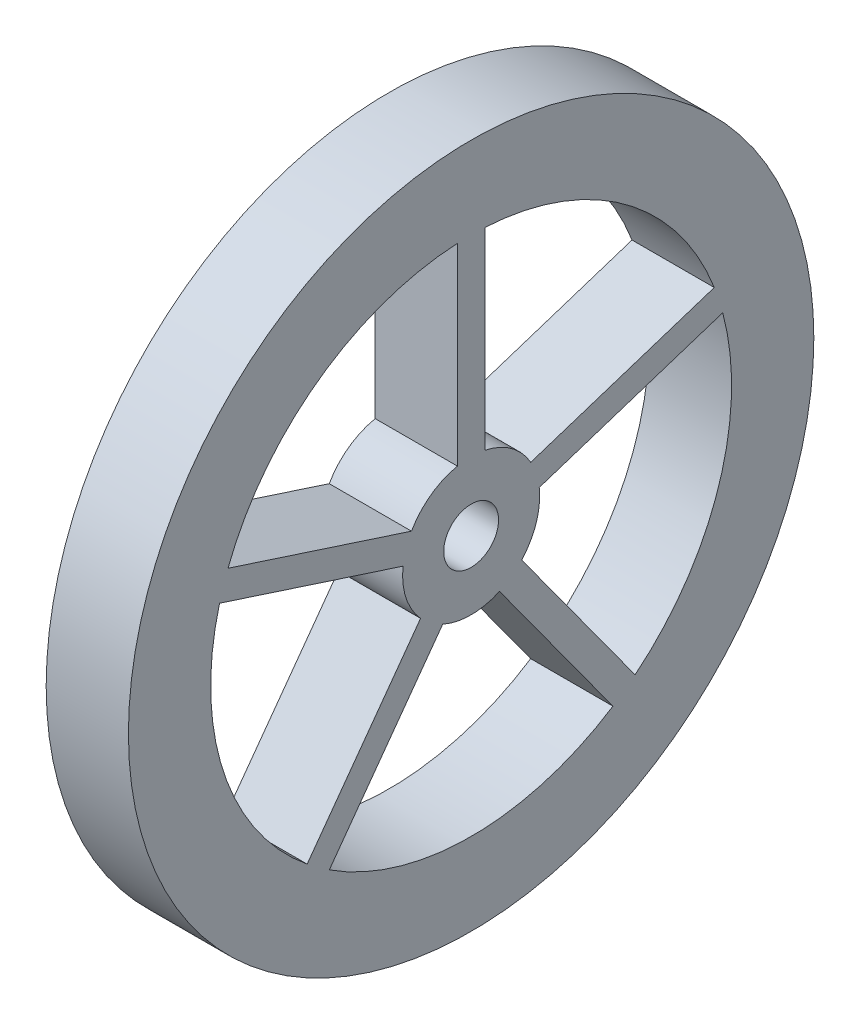
ISO-10303-21;
HEADER;
FILE_DESCRIPTION(('STEP AP214'),'2;1');
FILE_NAME('part.step','',(''),(''),'','','');
FILE_SCHEMA(('AUTOMOTIVE_DESIGN { 1 0 10303 214 1 1 1 1 }'));
ENDSEC;
DATA;
#1=APPLICATION_CONTEXT('core data for automotive mechanical design processes');
#2=APPLICATION_PROTOCOL_DEFINITION('international standard','automotive_design',2000,#1);
#3=PRODUCT_CONTEXT('',#1,'mechanical');
#4=PRODUCT('Part','Part','',(#3));
#5=PRODUCT_RELATED_PRODUCT_CATEGORY('part','',(#4));
#6=PRODUCT_DEFINITION_FORMATION('','',#4);
#7=PRODUCT_DEFINITION_CONTEXT('part definition',#1,'design');
#8=PRODUCT_DEFINITION('design','',#6,#7);
#9=PRODUCT_DEFINITION_SHAPE('','',#8);
#10=(LENGTH_UNIT() NAMED_UNIT(*) SI_UNIT(.MILLI.,.METRE.));
#11=(NAMED_UNIT(*) PLANE_ANGLE_UNIT() SI_UNIT($,.RADIAN.));
#12=(NAMED_UNIT(*) SI_UNIT($,.STERADIAN.) SOLID_ANGLE_UNIT());
#13=UNCERTAINTY_MEASURE_WITH_UNIT(LENGTH_MEASURE(1.E-05),#10,'distance_accuracy_value','');
#14=(GEOMETRIC_REPRESENTATION_CONTEXT(3) GLOBAL_UNCERTAINTY_ASSIGNED_CONTEXT((#13)) GLOBAL_UNIT_ASSIGNED_CONTEXT((#10,
#11,#12)) REPRESENTATION_CONTEXT('',''));
#15=CARTESIAN_POINT('',(0.,0.,0.));
#16=DIRECTION('',(0.,0.,1.));
#17=DIRECTION('',(1.,0.,0.));
#18=AXIS2_PLACEMENT_3D('',#15,#16,#17);
#19=CARTESIAN_POINT('',(60.,0.,0.));
#20=DIRECTION('',(1.,0.,0.));
#21=DIRECTION('',(0.,0.,-1.));
#22=AXIS2_PLACEMENT_3D('',#19,#20,#21);
#23=PLANE('',#22);
#24=CARTESIAN_POINT('',(60.,0.,0.));
#25=DIRECTION('',(1.,0.,0.));
#26=DIRECTION('',(0.,0.,-1.));
#27=AXIS2_PLACEMENT_3D('',#24,#25,#26);
#28=CIRCLE('',#27,250.);
#29=CARTESIAN_POINT('',(60.,0.,-250.));
#30=VERTEX_POINT('',#29);
#31=EDGE_CURVE('E11',#30,#30,#28,.T.);
#32=ORIENTED_EDGE('',*,*,#31,.T.);
#33=EDGE_LOOP('',(#32));
#34=FACE_BOUND('',#33,.T.);
#35=CARTESIAN_POINT('',(60.,0.,0.));
#36=DIRECTION('',(1.,0.,0.));
#37=DIRECTION('',(0.,0.,-1.));
#38=AXIS2_PLACEMENT_3D('',#35,#36,#37);
#39=CIRCLE('',#38,20.);
#40=CARTESIAN_POINT('',(60.,0.,-20.));
#41=VERTEX_POINT('',#40);
#42=EDGE_CURVE('E334',#41,#41,#39,.T.);
#43=ORIENTED_EDGE('',*,*,#42,.F.);
#44=EDGE_LOOP('',(#43));
#45=FACE_BOUND('',#44,.T.);
#46=DIRECTION('',(0.,-1.,0.));
#47=VECTOR('',#46,1.);
#48=CARTESIAN_POINT('',(60.,189.736659610103,-9.99999999999997));
#49=LINE('',#48,#47);
#50=CARTESIAN_POINT('',(60.,189.736659610103,-9.99999999999997));
#51=VERTEX_POINT('',#50);
#52=CARTESIAN_POINT('',(60.,48.9897948556761,-9.99999999999997));
#53=VERTEX_POINT('',#52);
#54=EDGE_CURVE('E305',#51,#53,#49,.T.);
#55=ORIENTED_EDGE('',*,*,#54,.F.);
#56=CARTESIAN_POINT('',(60.,0.,0.));
#57=DIRECTION('',(1.,0.,0.));
#58=DIRECTION('',(0.,0.,-1.));
#59=AXIS2_PLACEMENT_3D('',#56,#57,#58);
#60=CIRCLE('',#59,190.);
#61=CARTESIAN_POINT('',(60.,68.1424174384075,-177.360116558514));
#62=VERTEX_POINT('',#61);
#63=EDGE_CURVE('E303',#62,#51,#60,.T.);
#64=ORIENTED_EDGE('',*,*,#63,.F.);
#65=DIRECTION('',(0.,0.309016994374927,-0.95105651629516));
#66=VECTOR('',#65,1.);
#67=CARTESIAN_POINT('',(60.,68.1424174384075,-177.360116558514));
#68=LINE('',#67,#66);
#69=CARTESIAN_POINT('',(60.,24.6492443243,-43.5018936857028));
#70=VERTEX_POINT('',#69);
#71=EDGE_CURVE('E311',#70,#62,#68,.T.);
#72=ORIENTED_EDGE('',*,*,#71,.F.);
#73=CARTESIAN_POINT('',(60.,0.,0.));
#74=DIRECTION('',(-1.,0.,0.));
#75=DIRECTION('',(0.,0.,-1.));
#76=AXIS2_PLACEMENT_3D('',#73,#74,#75);
#77=CIRCLE('',#76,50.0000000000123);
#78=EDGE_CURVE('E308',#53,#70,#77,.T.);
#79=ORIENTED_EDGE('',*,*,#78,.F.);
#80=EDGE_LOOP('',(#55,#64,#72,#79));
#81=FACE_BOUND('',#80,.T.);
#82=DIRECTION('',(0.,-0.309016994374962,-0.951056516295149));
#83=VECTOR('',#82,1.);
#84=CARTESIAN_POINT('',(60.,68.14241743841,177.360116558513));
#85=LINE('',#84,#83);
#86=CARTESIAN_POINT('',(60.,68.14241743841,177.360116558513));
#87=VERTEX_POINT('',#86);
#88=CARTESIAN_POINT('',(60.,24.649244324298,43.5018936857057));
#89=VERTEX_POINT('',#88);
#90=EDGE_CURVE('E274',#87,#89,#85,.T.);
#91=ORIENTED_EDGE('',*,*,#90,.F.);
#92=CARTESIAN_POINT('',(60.,0.,0.));
#93=DIRECTION('',(1.,0.,0.));
#94=DIRECTION('',(0.,0.,-1.));
#95=AXIS2_PLACEMENT_3D('',#92,#93,#94);
#96=CIRCLE('',#95,190.);
#97=CARTESIAN_POINT('',(60.,189.736659610103,10.));
#98=VERTEX_POINT('',#97);
#99=EDGE_CURVE('E272',#98,#87,#96,.T.);
#100=ORIENTED_EDGE('',*,*,#99,.F.);
#101=DIRECTION('',(0.,1.,0.));
#102=VECTOR('',#101,1.);
#103=CARTESIAN_POINT('',(60.,189.736659610103,10.));
#104=LINE('',#103,#102);
#105=CARTESIAN_POINT('',(60.,48.9897948556756,10.0000000000025));
#106=VERTEX_POINT('',#105);
#107=EDGE_CURVE('E280',#106,#98,#104,.T.);
#108=ORIENTED_EDGE('',*,*,#107,.F.);
#109=CARTESIAN_POINT('',(60.,0.,0.));
#110=DIRECTION('',(-1.,0.,0.));
#111=DIRECTION('',(0.,0.,-1.));
#112=AXIS2_PLACEMENT_3D('',#109,#110,#111);
#113=CIRCLE('',#112,50.0000000000138);
#114=EDGE_CURVE('E277',#89,#106,#113,.T.);
#115=ORIENTED_EDGE('',*,*,#114,.F.);
#116=EDGE_LOOP('',(#91,#100,#108,#115));
#117=FACE_BOUND('',#116,.T.);
#118=DIRECTION('',(0.,-0.309016994374944,0.951056516295155));
#119=VECTOR('',#118,1.);
#120=CARTESIAN_POINT('',(60.,49.1212871125044,-183.540456446013));
#121=LINE('',#120,#119);
#122=CARTESIAN_POINT('',(60.,49.1212871125044,-183.540456446013));
#123=VERTEX_POINT('',#122);
#124=CARTESIAN_POINT('',(60.,5.62811399839478,-49.682233573203));
#125=VERTEX_POINT('',#124);
#126=EDGE_CURVE('E243',#123,#125,#121,.T.);
#127=ORIENTED_EDGE('',*,*,#126,.F.);
#128=CARTESIAN_POINT('',(60.,0.,0.));
#129=DIRECTION('',(1.,0.,0.));
#130=DIRECTION('',(0.,0.,-1.));
#131=AXIS2_PLACEMENT_3D('',#128,#129,#130);
#132=CIRCLE('',#131,190.);
#133=CARTESIAN_POINT('',(60.,-147.622329557583,-119.614580281805));
#134=VERTEX_POINT('',#133);
#135=EDGE_CURVE('E241',#134,#123,#132,.T.);
#136=ORIENTED_EDGE('',*,*,#135,.F.);
#137=DIRECTION('',(0.,-0.809016994374957,-0.587785252292459));
#138=VECTOR('',#137,1.);
#139=CARTESIAN_POINT('',(60.,-147.622329557583,-119.614580281805));
#140=LINE('',#139,#138);
#141=CARTESIAN_POINT('',(60.,-33.7557240662578,-36.8856488727513));
#142=VERTEX_POINT('',#141);
#143=EDGE_CURVE('E249',#142,#134,#140,.T.);
#144=ORIENTED_EDGE('',*,*,#143,.F.);
#145=CARTESIAN_POINT('',(60.,0.,0.));
#146=DIRECTION('',(-1.,0.,0.));
#147=DIRECTION('',(0.,0.,-1.));
#148=AXIS2_PLACEMENT_3D('',#145,#146,#147);
#149=CIRCLE('',#148,50.0000000000123);
#150=EDGE_CURVE('E246',#125,#142,#149,.T.);
#151=ORIENTED_EDGE('',*,*,#150,.F.);
#152=EDGE_LOOP('',(#127,#136,#144,#151));
#153=FACE_BOUND('',#152,.T.);
#154=DIRECTION('',(0.,0.809016994374947,0.587785252292473));
#155=VECTOR('',#154,1.);
#156=CARTESIAN_POINT('',(60.,-159.378034603432,-103.434240394306));
#157=LINE('',#156,#155);
#158=CARTESIAN_POINT('',(60.,-159.378034603432,-103.434240394306));
#159=VERTEX_POINT('',#158);
#160=CARTESIAN_POINT('',(60.,-45.511429112109,-20.7053089852506));
#161=VERTEX_POINT('',#160);
#162=EDGE_CURVE('E212',#159,#161,#157,.T.);
#163=ORIENTED_EDGE('',*,*,#162,.F.);
#164=CARTESIAN_POINT('',(60.,0.,0.));
#165=DIRECTION('',(1.,0.,0.));
#166=DIRECTION('',(0.,0.,-1.));
#167=AXIS2_PLACEMENT_3D('',#164,#165,#166);
#168=CIRCLE('',#167,190.);
#169=CARTESIAN_POINT('',(60.,-159.378034603433,103.434240394306));
#170=VERTEX_POINT('',#169);
#171=EDGE_CURVE('E210',#170,#159,#168,.T.);
#172=ORIENTED_EDGE('',*,*,#171,.F.);
#173=DIRECTION('',(0.,-0.809016994374937,0.587785252292487));
#174=VECTOR('',#173,1.);
#175=CARTESIAN_POINT('',(60.,-159.378034603433,103.434240394306));
#176=LINE('',#175,#174);
#177=CARTESIAN_POINT('',(60.,-45.5114291121101,20.7053089852483));
#178=VERTEX_POINT('',#177);
#179=EDGE_CURVE('E218',#178,#170,#176,.T.);
#180=ORIENTED_EDGE('',*,*,#179,.F.);
#181=CARTESIAN_POINT('',(60.,0.,0.));
#182=DIRECTION('',(-1.,0.,0.));
#183=DIRECTION('',(0.,0.,-1.));
#184=AXIS2_PLACEMENT_3D('',#181,#182,#183);
#185=CIRCLE('',#184,50.0000000000123);
#186=EDGE_CURVE('E215',#161,#178,#185,.T.);
#187=ORIENTED_EDGE('',*,*,#186,.F.);
#188=EDGE_LOOP('',(#163,#172,#180,#187));
#189=FACE_BOUND('',#188,.T.);
#190=DIRECTION('',(0.,0.809016994374947,-0.587785252292473));
#191=VECTOR('',#190,1.);
#192=CARTESIAN_POINT('',(60.,-147.622329557583,119.614580281805));
#193=LINE('',#192,#191);
#194=CARTESIAN_POINT('',(60.,-147.622329557583,119.614580281805));
#195=VERTEX_POINT('',#194);
#196=CARTESIAN_POINT('',(60.,-33.7557240662596,36.8856488727495));
#197=VERTEX_POINT('',#196);
#198=EDGE_CURVE('E182',#195,#197,#193,.T.);
#199=ORIENTED_EDGE('',*,*,#198,.F.);
#200=CARTESIAN_POINT('',(60.,0.,0.));
#201=DIRECTION('',(1.,0.,0.));
#202=DIRECTION('',(0.,0.,-1.));
#203=AXIS2_PLACEMENT_3D('',#200,#201,#202);
#204=CIRCLE('',#203,190.);
#205=CARTESIAN_POINT('',(60.,49.1212871125019,183.540456446014));
#206=VERTEX_POINT('',#205);
#207=EDGE_CURVE('E174',#206,#195,#204,.T.);
#208=ORIENTED_EDGE('',*,*,#207,.F.);
#209=DIRECTION('',(0.,0.309016994374943,0.951056516295155));
#210=VECTOR('',#209,1.);
#211=CARTESIAN_POINT('',(60.,49.1212871125019,183.540456446014));
#212=LINE('',#211,#210);
#213=CARTESIAN_POINT('',(60.,5.62811399839223,49.6822335732033));
#214=VERTEX_POINT('',#213);
#215=EDGE_CURVE('E196',#214,#206,#212,.T.);
#216=ORIENTED_EDGE('',*,*,#215,.F.);
#217=CARTESIAN_POINT('',(60.,0.,0.));
#218=DIRECTION('',(-1.,0.,0.));
#219=DIRECTION('',(0.,0.,-1.));
#220=AXIS2_PLACEMENT_3D('',#217,#218,#219);
#221=CIRCLE('',#220,50.0000000000123);
#222=EDGE_CURVE('E194',#197,#214,#221,.T.);
#223=ORIENTED_EDGE('',*,*,#222,.F.);
#224=EDGE_LOOP('',(#199,#208,#216,#223));
#225=FACE_BOUND('',#224,.T.);
#226=ADVANCED_FACE('F37',(#34,#45,#81,#117,#153,#189,#225),#23,.T.);
#227=CARTESIAN_POINT('',(0.,0.,0.));
#228=DIRECTION('',(1.,0.,0.));
#229=DIRECTION('',(0.,0.,-1.));
#230=AXIS2_PLACEMENT_3D('',#227,#228,#229);
#231=PLANE('',#230);
#232=CARTESIAN_POINT('',(0.,0.,0.));
#233=DIRECTION('',(1.,0.,0.));
#234=DIRECTION('',(0.,0.,-1.));
#235=AXIS2_PLACEMENT_3D('',#232,#233,#234);
#236=CIRCLE('',#235,190.);
#237=CARTESIAN_POINT('',(0.,-159.378034603433,103.434240394306));
#238=VERTEX_POINT('',#237);
#239=CARTESIAN_POINT('',(0.,-159.378034603432,-103.434240394306));
#240=VERTEX_POINT('',#239);
#241=EDGE_CURVE('E190',#238,#240,#236,.T.);
#242=ORIENTED_EDGE('',*,*,#241,.T.);
#243=DIRECTION('',(0.,0.809016994374947,0.587785252292473));
#244=VECTOR('',#243,1.);
#245=CARTESIAN_POINT('',(0.,-159.378034603432,-103.434240394306));
#246=LINE('',#245,#244);
#247=CARTESIAN_POINT('',(0.,-45.511429112109,-20.7053089852506));
#248=VERTEX_POINT('',#247);
#249=EDGE_CURVE('E223',#240,#248,#246,.T.);
#250=ORIENTED_EDGE('',*,*,#249,.T.);
#251=CARTESIAN_POINT('',(0.,0.,0.));
#252=DIRECTION('',(-1.,0.,0.));
#253=DIRECTION('',(0.,0.,-1.));
#254=AXIS2_PLACEMENT_3D('',#251,#252,#253);
#255=CIRCLE('',#254,50.0000000000123);
#256=CARTESIAN_POINT('',(0.,-45.5114291121101,20.7053089852483));
#257=VERTEX_POINT('',#256);
#258=EDGE_CURVE('E226',#248,#257,#255,.T.);
#259=ORIENTED_EDGE('',*,*,#258,.T.);
#260=DIRECTION('',(0.,-0.809016994374937,0.587785252292487));
#261=VECTOR('',#260,1.);
#262=CARTESIAN_POINT('',(0.,-159.378034603433,103.434240394306));
#263=LINE('',#262,#261);
#264=EDGE_CURVE('E213',#257,#238,#263,.T.);
#265=ORIENTED_EDGE('',*,*,#264,.T.);
#266=EDGE_LOOP('',(#242,#250,#259,#265));
#267=FACE_BOUND('',#266,.T.);
#268=CARTESIAN_POINT('',(0.,0.,0.));
#269=DIRECTION('',(1.,0.,0.));
#270=DIRECTION('',(0.,0.,-1.));
#271=AXIS2_PLACEMENT_3D('',#268,#269,#270);
#272=CIRCLE('',#271,190.);
#273=CARTESIAN_POINT('',(0.,189.736659610103,10.));
#274=VERTEX_POINT('',#273);
#275=CARTESIAN_POINT('',(0.,68.14241743841,177.360116558513));
#276=VERTEX_POINT('',#275);
#277=EDGE_CURVE('E271',#274,#276,#272,.T.);
#278=ORIENTED_EDGE('',*,*,#277,.T.);
#279=DIRECTION('',(0.,-0.309016994374962,-0.951056516295149));
#280=VECTOR('',#279,1.);
#281=CARTESIAN_POINT('',(0.,68.14241743841,177.360116558513));
#282=LINE('',#281,#280);
#283=CARTESIAN_POINT('',(0.,24.649244324298,43.5018936857057));
#284=VERTEX_POINT('',#283);
#285=EDGE_CURVE('E285',#276,#284,#282,.T.);
#286=ORIENTED_EDGE('',*,*,#285,.T.);
#287=CARTESIAN_POINT('',(0.,0.,0.));
#288=DIRECTION('',(-1.,0.,0.));
#289=DIRECTION('',(0.,0.,-1.));
#290=AXIS2_PLACEMENT_3D('',#287,#288,#289);
#291=CIRCLE('',#290,50.0000000000138);
#292=CARTESIAN_POINT('',(0.,48.9897948556756,10.0000000000025));
#293=VERTEX_POINT('',#292);
#294=EDGE_CURVE('E288',#284,#293,#291,.T.);
#295=ORIENTED_EDGE('',*,*,#294,.T.);
#296=DIRECTION('',(0.,1.,0.));
#297=VECTOR('',#296,1.);
#298=CARTESIAN_POINT('',(0.,189.736659610103,10.));
#299=LINE('',#298,#297);
#300=EDGE_CURVE('E275',#293,#274,#299,.T.);
#301=ORIENTED_EDGE('',*,*,#300,.T.);
#302=EDGE_LOOP('',(#278,#286,#295,#301));
#303=FACE_BOUND('',#302,.T.);
#304=CARTESIAN_POINT('',(0.,0.,0.));
#305=DIRECTION('',(1.,0.,0.));
#306=DIRECTION('',(0.,0.,-1.));
#307=AXIS2_PLACEMENT_3D('',#304,#305,#306);
#308=CIRCLE('',#307,20.);
#309=CARTESIAN_POINT('',(0.,0.,-20.));
#310=VERTEX_POINT('',#309);
#311=EDGE_CURVE('E333',#310,#310,#308,.T.);
#312=ORIENTED_EDGE('',*,*,#311,.T.);
#313=EDGE_LOOP('',(#312));
#314=FACE_BOUND('',#313,.T.);
#315=CARTESIAN_POINT('',(0.,0.,0.));
#316=DIRECTION('',(1.,0.,0.));
#317=DIRECTION('',(0.,0.,-1.));
#318=AXIS2_PLACEMENT_3D('',#315,#316,#317);
#319=CIRCLE('',#318,250.);
#320=CARTESIAN_POINT('',(0.,0.,-250.));
#321=VERTEX_POINT('',#320);
#322=EDGE_CURVE('E41',#321,#321,#319,.T.);
#323=ORIENTED_EDGE('',*,*,#322,.F.);
#324=EDGE_LOOP('',(#323));
#325=FACE_BOUND('',#324,.T.);
#326=CARTESIAN_POINT('',(0.,0.,0.));
#327=DIRECTION('',(1.,0.,0.));
#328=DIRECTION('',(0.,0.,-1.));
#329=AXIS2_PLACEMENT_3D('',#326,#327,#328);
#330=CIRCLE('',#329,190.);
#331=CARTESIAN_POINT('',(0.,68.1424174384075,-177.360116558514));
#332=VERTEX_POINT('',#331);
#333=CARTESIAN_POINT('',(0.,189.736659610103,-9.99999999999997));
#334=VERTEX_POINT('',#333);
#335=EDGE_CURVE('E302',#332,#334,#330,.T.);
#336=ORIENTED_EDGE('',*,*,#335,.T.);
#337=DIRECTION('',(0.,-1.,0.));
#338=VECTOR('',#337,1.);
#339=CARTESIAN_POINT('',(0.,189.736659610103,-9.99999999999997));
#340=LINE('',#339,#338);
#341=CARTESIAN_POINT('',(0.,48.9897948556761,-9.99999999999997));
#342=VERTEX_POINT('',#341);
#343=EDGE_CURVE('E316',#334,#342,#340,.T.);
#344=ORIENTED_EDGE('',*,*,#343,.T.);
#345=CARTESIAN_POINT('',(0.,0.,0.));
#346=DIRECTION('',(-1.,0.,0.));
#347=DIRECTION('',(0.,0.,-1.));
#348=AXIS2_PLACEMENT_3D('',#345,#346,#347);
#349=CIRCLE('',#348,50.0000000000123);
#350=CARTESIAN_POINT('',(0.,24.6492443243,-43.5018936857028));
#351=VERTEX_POINT('',#350);
#352=EDGE_CURVE('E319',#342,#351,#349,.T.);
#353=ORIENTED_EDGE('',*,*,#352,.T.);
#354=DIRECTION('',(0.,0.309016994374927,-0.95105651629516));
#355=VECTOR('',#354,1.);
#356=CARTESIAN_POINT('',(0.,68.1424174384075,-177.360116558514));
#357=LINE('',#356,#355);
#358=EDGE_CURVE('E306',#351,#332,#357,.T.);
#359=ORIENTED_EDGE('',*,*,#358,.T.);
#360=EDGE_LOOP('',(#336,#344,#353,#359));
#361=FACE_BOUND('',#360,.T.);
#362=CARTESIAN_POINT('',(0.,0.,0.));
#363=DIRECTION('',(1.,0.,0.));
#364=DIRECTION('',(0.,0.,-1.));
#365=AXIS2_PLACEMENT_3D('',#362,#363,#364);
#366=CIRCLE('',#365,190.);
#367=CARTESIAN_POINT('',(0.,-147.622329557583,-119.614580281805));
#368=VERTEX_POINT('',#367);
#369=CARTESIAN_POINT('',(0.,49.1212871125044,-183.540456446013));
#370=VERTEX_POINT('',#369);
#371=EDGE_CURVE('E240',#368,#370,#366,.T.);
#372=ORIENTED_EDGE('',*,*,#371,.T.);
#373=DIRECTION('',(0.,-0.309016994374944,0.951056516295155));
#374=VECTOR('',#373,1.);
#375=CARTESIAN_POINT('',(0.,49.1212871125044,-183.540456446013));
#376=LINE('',#375,#374);
#377=CARTESIAN_POINT('',(0.,5.62811399839478,-49.682233573203));
#378=VERTEX_POINT('',#377);
#379=EDGE_CURVE('E254',#370,#378,#376,.T.);
#380=ORIENTED_EDGE('',*,*,#379,.T.);
#381=CARTESIAN_POINT('',(0.,0.,0.));
#382=DIRECTION('',(-1.,0.,0.));
#383=DIRECTION('',(0.,0.,-1.));
#384=AXIS2_PLACEMENT_3D('',#381,#382,#383);
#385=CIRCLE('',#384,50.0000000000123);
#386=CARTESIAN_POINT('',(0.,-33.7557240662578,-36.8856488727512));
#387=VERTEX_POINT('',#386);
#388=EDGE_CURVE('E257',#378,#387,#385,.T.);
#389=ORIENTED_EDGE('',*,*,#388,.T.);
#390=DIRECTION('',(0.,-0.809016994374957,-0.587785252292459));
#391=VECTOR('',#390,1.);
#392=CARTESIAN_POINT('',(0.,-147.622329557583,-119.614580281805));
#393=LINE('',#392,#391);
#394=EDGE_CURVE('E244',#387,#368,#393,.T.);
#395=ORIENTED_EDGE('',*,*,#394,.T.);
#396=EDGE_LOOP('',(#372,#380,#389,#395));
#397=FACE_BOUND('',#396,.T.);
#398=CARTESIAN_POINT('',(0.,0.,0.));
#399=DIRECTION('',(1.,0.,0.));
#400=DIRECTION('',(0.,0.,-1.));
#401=AXIS2_PLACEMENT_3D('',#398,#399,#400);
#402=CIRCLE('',#401,190.);
#403=CARTESIAN_POINT('',(0.,49.1212871125019,183.540456446014));
#404=VERTEX_POINT('',#403);
#405=CARTESIAN_POINT('',(0.,-147.622329557583,119.614580281805));
#406=VERTEX_POINT('',#405);
#407=EDGE_CURVE('E60',#404,#406,#402,.T.);
#408=ORIENTED_EDGE('',*,*,#407,.T.);
#409=DIRECTION('',(0.,0.809016994374947,-0.587785252292473));
#410=VECTOR('',#409,1.);
#411=CARTESIAN_POINT('',(0.,-147.622329557583,119.614580281805));
#412=LINE('',#411,#410);
#413=CARTESIAN_POINT('',(0.,-33.7557240662596,36.8856488727495));
#414=VERTEX_POINT('',#413);
#415=EDGE_CURVE('E189',#406,#414,#412,.T.);
#416=ORIENTED_EDGE('',*,*,#415,.T.);
#417=CARTESIAN_POINT('',(0.,0.,0.));
#418=DIRECTION('',(-1.,0.,0.));
#419=DIRECTION('',(0.,0.,-1.));
#420=AXIS2_PLACEMENT_3D('',#417,#418,#419);
#421=CIRCLE('',#420,50.0000000000123);
#422=CARTESIAN_POINT('',(0.,5.62811399839224,49.6822335732033));
#423=VERTEX_POINT('',#422);
#424=EDGE_CURVE('E202',#414,#423,#421,.T.);
#425=ORIENTED_EDGE('',*,*,#424,.T.);
#426=DIRECTION('',(0.,0.309016994374943,0.951056516295155));
#427=VECTOR('',#426,1.);
#428=CARTESIAN_POINT('',(0.,49.1212871125019,183.540456446014));
#429=LINE('',#428,#427);
#430=EDGE_CURVE('E183',#423,#404,#429,.T.);
#431=ORIENTED_EDGE('',*,*,#430,.T.);
#432=EDGE_LOOP('',(#408,#416,#425,#431));
#433=FACE_BOUND('',#432,.T.);
#434=ADVANCED_FACE('F340',(#267,#303,#314,#325,#361,#397,#433),#231,.F.);
#435=CARTESIAN_POINT('',(60.,0.,0.));
#436=DIRECTION('',(-1.,0.,0.));
#437=DIRECTION('',(0.,0.,1.));
#438=AXIS2_PLACEMENT_3D('',#435,#436,#437);
#439=CYLINDRICAL_SURFACE('',#438,250.);
#440=ORIENTED_EDGE('',*,*,#31,.F.);
#441=EDGE_LOOP('',(#440));
#442=FACE_BOUND('',#441,.T.);
#443=ORIENTED_EDGE('',*,*,#322,.T.);
#444=EDGE_LOOP('',(#443));
#445=FACE_BOUND('',#444,.T.);
#446=ADVANCED_FACE('F39',(#442,#445),#439,.T.);
#447=CARTESIAN_POINT('',(60.,0.,0.));
#448=DIRECTION('',(-1.,0.,0.));
#449=DIRECTION('',(0.,0.,1.));
#450=AXIS2_PLACEMENT_3D('',#447,#448,#449);
#451=CYLINDRICAL_SURFACE('',#450,20.);
#452=ORIENTED_EDGE('',*,*,#42,.T.);
#453=EDGE_LOOP('',(#452));
#454=FACE_BOUND('',#453,.T.);
#455=ORIENTED_EDGE('',*,*,#311,.F.);
#456=EDGE_LOOP('',(#455));
#457=FACE_BOUND('',#456,.T.);
#458=ADVANCED_FACE('F343',(#454,#457),#451,.F.);
#459=CARTESIAN_POINT('',(60.,0.,0.));
#460=DIRECTION('',(-1.,0.,0.));
#461=DIRECTION('',(0.,0.,1.));
#462=AXIS2_PLACEMENT_3D('',#459,#460,#461);
#463=CYLINDRICAL_SURFACE('',#462,190.);
#464=ORIENTED_EDGE('',*,*,#335,.F.);
#465=DIRECTION('',(-1.,0.,0.));
#466=VECTOR('',#465,1.);
#467=CARTESIAN_POINT('',(60.,68.1424174384075,-177.360116558514));
#468=LINE('',#467,#466);
#469=EDGE_CURVE('E313',#62,#332,#468,.T.);
#470=ORIENTED_EDGE('',*,*,#469,.F.);
#471=ORIENTED_EDGE('',*,*,#63,.T.);
#472=DIRECTION('',(-1.,0.,0.));
#473=VECTOR('',#472,1.);
#474=CARTESIAN_POINT('',(60.,189.736659610103,-9.99999999999997));
#475=LINE('',#474,#473);
#476=EDGE_CURVE('E330',#51,#334,#475,.T.);
#477=ORIENTED_EDGE('',*,*,#476,.T.);
#478=EDGE_LOOP('',(#464,#470,#471,#477));
#479=FACE_BOUND('',#478,.T.);
#480=ADVANCED_FACE('F345',(#479),#463,.F.);
#481=CARTESIAN_POINT('',(60.,189.736659610103,-9.99999999999997));
#482=DIRECTION('',(0.,0.,-1.));
#483=DIRECTION('',(0.,1.,0.));
#484=AXIS2_PLACEMENT_3D('',#481,#482,#483);
#485=PLANE('',#484);
#486=ORIENTED_EDGE('',*,*,#343,.F.);
#487=ORIENTED_EDGE('',*,*,#476,.F.);
#488=ORIENTED_EDGE('',*,*,#54,.T.);
#489=DIRECTION('',(-1.,0.,0.));
#490=VECTOR('',#489,1.);
#491=CARTESIAN_POINT('',(60.,48.9897948556761,-9.99999999999997));
#492=LINE('',#491,#490);
#493=EDGE_CURVE('E328',#53,#342,#492,.T.);
#494=ORIENTED_EDGE('',*,*,#493,.T.);
#495=EDGE_LOOP('',(#486,#487,#488,#494));
#496=FACE_BOUND('',#495,.T.);
#497=ADVANCED_FACE('F352',(#496),#485,.T.);
#498=CARTESIAN_POINT('',(60.,0.,0.));
#499=DIRECTION('',(-1.,0.,0.));
#500=DIRECTION('',(0.,0.,1.));
#501=AXIS2_PLACEMENT_3D('',#498,#499,#500);
#502=CYLINDRICAL_SURFACE('',#501,50.0000000000123);
#503=ORIENTED_EDGE('',*,*,#352,.F.);
#504=ORIENTED_EDGE('',*,*,#493,.F.);
#505=ORIENTED_EDGE('',*,*,#78,.T.);
#506=DIRECTION('',(-1.,0.,0.));
#507=VECTOR('',#506,1.);
#508=CARTESIAN_POINT('',(60.,24.6492443243,-43.5018936857028));
#509=LINE('',#508,#507);
#510=EDGE_CURVE('E326',#70,#351,#509,.T.);
#511=ORIENTED_EDGE('',*,*,#510,.T.);
#512=EDGE_LOOP('',(#503,#504,#505,#511));
#513=FACE_BOUND('',#512,.T.);
#514=ADVANCED_FACE('F446',(#513),#502,.T.);
#515=CARTESIAN_POINT('',(60.,68.1424174384075,-177.360116558514));
#516=DIRECTION('',(0.,0.95105651629516,0.309016994374927));
#517=DIRECTION('',(0.,-0.309016994374927,0.95105651629516));
#518=AXIS2_PLACEMENT_3D('',#515,#516,#517);
#519=PLANE('',#518);
#520=ORIENTED_EDGE('',*,*,#358,.F.);
#521=ORIENTED_EDGE('',*,*,#510,.F.);
#522=ORIENTED_EDGE('',*,*,#71,.T.);
#523=ORIENTED_EDGE('',*,*,#469,.T.);
#524=EDGE_LOOP('',(#520,#521,#522,#523));
#525=FACE_BOUND('',#524,.T.);
#526=ADVANCED_FACE('F442',(#525),#519,.T.);
#527=CARTESIAN_POINT('',(60.,0.,0.));
#528=DIRECTION('',(-1.,0.,0.));
#529=DIRECTION('',(0.,0.,1.));
#530=AXIS2_PLACEMENT_3D('',#527,#528,#529);
#531=CYLINDRICAL_SURFACE('',#530,190.);
#532=ORIENTED_EDGE('',*,*,#277,.F.);
#533=DIRECTION('',(-1.,0.,0.));
#534=VECTOR('',#533,1.);
#535=CARTESIAN_POINT('',(60.,189.736659610103,10.));
#536=LINE('',#535,#534);
#537=EDGE_CURVE('E282',#98,#274,#536,.T.);
#538=ORIENTED_EDGE('',*,*,#537,.F.);
#539=ORIENTED_EDGE('',*,*,#99,.T.);
#540=DIRECTION('',(-1.,0.,0.));
#541=VECTOR('',#540,1.);
#542=CARTESIAN_POINT('',(60.,68.14241743841,177.360116558513));
#543=LINE('',#542,#541);
#544=EDGE_CURVE('E299',#87,#276,#543,.T.);
#545=ORIENTED_EDGE('',*,*,#544,.T.);
#546=EDGE_LOOP('',(#532,#538,#539,#545));
#547=FACE_BOUND('',#546,.T.);
#548=ADVANCED_FACE('F438',(#547),#531,.F.);
#549=CARTESIAN_POINT('',(60.,68.14241743841,177.360116558513));
#550=DIRECTION('',(0.,0.951056516295149,-0.309016994374962));
#551=DIRECTION('',(0.,0.309016994374962,0.951056516295149));
#552=AXIS2_PLACEMENT_3D('',#549,#550,#551);
#553=PLANE('',#552);
#554=ORIENTED_EDGE('',*,*,#285,.F.);
#555=ORIENTED_EDGE('',*,*,#544,.F.);
#556=ORIENTED_EDGE('',*,*,#90,.T.);
#557=DIRECTION('',(-1.,0.,0.));
#558=VECTOR('',#557,1.);
#559=CARTESIAN_POINT('',(60.,24.649244324298,43.5018936857057));
#560=LINE('',#559,#558);
#561=EDGE_CURVE('E297',#89,#284,#560,.T.);
#562=ORIENTED_EDGE('',*,*,#561,.T.);
#563=EDGE_LOOP('',(#554,#555,#556,#562));
#564=FACE_BOUND('',#563,.T.);
#565=ADVANCED_FACE('F434',(#564),#553,.T.);
#566=CARTESIAN_POINT('',(60.,0.,0.));
#567=DIRECTION('',(-1.,0.,0.));
#568=DIRECTION('',(0.,0.,1.));
#569=AXIS2_PLACEMENT_3D('',#566,#567,#568);
#570=CYLINDRICAL_SURFACE('',#569,50.0000000000138);
#571=ORIENTED_EDGE('',*,*,#294,.F.);
#572=ORIENTED_EDGE('',*,*,#561,.F.);
#573=ORIENTED_EDGE('',*,*,#114,.T.);
#574=DIRECTION('',(-1.,0.,0.));
#575=VECTOR('',#574,1.);
#576=CARTESIAN_POINT('',(60.,48.9897948556756,10.0000000000025));
#577=LINE('',#576,#575);
#578=EDGE_CURVE('E295',#106,#293,#577,.T.);
#579=ORIENTED_EDGE('',*,*,#578,.T.);
#580=EDGE_LOOP('',(#571,#572,#573,#579));
#581=FACE_BOUND('',#580,.T.);
#582=ADVANCED_FACE('F430',(#581),#570,.T.);
#583=CARTESIAN_POINT('',(60.,189.736659610103,10.));
#584=DIRECTION('',(0.,0.,1.));
#585=DIRECTION('',(0.,-1.,0.));
#586=AXIS2_PLACEMENT_3D('',#583,#584,#585);
#587=PLANE('',#586);
#588=ORIENTED_EDGE('',*,*,#300,.F.);
#589=ORIENTED_EDGE('',*,*,#578,.F.);
#590=ORIENTED_EDGE('',*,*,#107,.T.);
#591=ORIENTED_EDGE('',*,*,#537,.T.);
#592=EDGE_LOOP('',(#588,#589,#590,#591));
#593=FACE_BOUND('',#592,.T.);
#594=ADVANCED_FACE('F426',(#593),#587,.T.);
#595=CARTESIAN_POINT('',(60.,0.,0.));
#596=DIRECTION('',(-1.,0.,0.));
#597=DIRECTION('',(0.,0.,1.));
#598=AXIS2_PLACEMENT_3D('',#595,#596,#597);
#599=CYLINDRICAL_SURFACE('',#598,190.);
#600=ORIENTED_EDGE('',*,*,#371,.F.);
#601=DIRECTION('',(-1.,0.,0.));
#602=VECTOR('',#601,1.);
#603=CARTESIAN_POINT('',(60.,-147.622329557583,-119.614580281805));
#604=LINE('',#603,#602);
#605=EDGE_CURVE('E251',#134,#368,#604,.T.);
#606=ORIENTED_EDGE('',*,*,#605,.F.);
#607=ORIENTED_EDGE('',*,*,#135,.T.);
#608=DIRECTION('',(-1.,0.,0.));
#609=VECTOR('',#608,1.);
#610=CARTESIAN_POINT('',(60.,49.1212871125044,-183.540456446013));
#611=LINE('',#610,#609);
#612=EDGE_CURVE('E268',#123,#370,#611,.T.);
#613=ORIENTED_EDGE('',*,*,#612,.T.);
#614=EDGE_LOOP('',(#600,#606,#607,#613));
#615=FACE_BOUND('',#614,.T.);
#616=ADVANCED_FACE('F422',(#615),#599,.F.);
#617=CARTESIAN_POINT('',(60.,49.1212871125044,-183.540456446013));
#618=DIRECTION('',(0.,-0.951056516295155,-0.309016994374944));
#619=DIRECTION('',(0.,0.309016994374944,-0.951056516295155));
#620=AXIS2_PLACEMENT_3D('',#617,#618,#619);
#621=PLANE('',#620);
#622=ORIENTED_EDGE('',*,*,#379,.F.);
#623=ORIENTED_EDGE('',*,*,#612,.F.);
#624=ORIENTED_EDGE('',*,*,#126,.T.);
#625=DIRECTION('',(-1.,0.,0.));
#626=VECTOR('',#625,1.);
#627=CARTESIAN_POINT('',(60.,5.62811399839478,-49.682233573203));
#628=LINE('',#627,#626);
#629=EDGE_CURVE('E266',#125,#378,#628,.T.);
#630=ORIENTED_EDGE('',*,*,#629,.T.);
#631=EDGE_LOOP('',(#622,#623,#624,#630));
#632=FACE_BOUND('',#631,.T.);
#633=ADVANCED_FACE('F418',(#632),#621,.T.);
#634=CARTESIAN_POINT('',(60.,0.,0.));
#635=DIRECTION('',(-1.,0.,0.));
#636=DIRECTION('',(0.,0.,1.));
#637=AXIS2_PLACEMENT_3D('',#634,#635,#636);
#638=CYLINDRICAL_SURFACE('',#637,50.0000000000123);
#639=ORIENTED_EDGE('',*,*,#388,.F.);
#640=ORIENTED_EDGE('',*,*,#629,.F.);
#641=ORIENTED_EDGE('',*,*,#150,.T.);
#642=DIRECTION('',(-1.,0.,0.));
#643=VECTOR('',#642,1.);
#644=CARTESIAN_POINT('',(60.,-33.7557240662578,-36.8856488727512));
#645=LINE('',#644,#643);
#646=EDGE_CURVE('E264',#142,#387,#645,.T.);
#647=ORIENTED_EDGE('',*,*,#646,.T.);
#648=EDGE_LOOP('',(#639,#640,#641,#647));
#649=FACE_BOUND('',#648,.T.);
#650=ADVANCED_FACE('F414',(#649),#638,.T.);
#651=CARTESIAN_POINT('',(60.,-147.622329557583,-119.614580281805));
#652=DIRECTION('',(0.,0.587785252292459,-0.809016994374957));
#653=DIRECTION('',(0.,0.809016994374957,0.587785252292459));
#654=AXIS2_PLACEMENT_3D('',#651,#652,#653);
#655=PLANE('',#654);
#656=ORIENTED_EDGE('',*,*,#394,.F.);
#657=ORIENTED_EDGE('',*,*,#646,.F.);
#658=ORIENTED_EDGE('',*,*,#143,.T.);
#659=ORIENTED_EDGE('',*,*,#605,.T.);
#660=EDGE_LOOP('',(#656,#657,#658,#659));
#661=FACE_BOUND('',#660,.T.);
#662=ADVANCED_FACE('F411',(#661),#655,.T.);
#663=CARTESIAN_POINT('',(60.,0.,0.));
#664=DIRECTION('',(-1.,0.,0.));
#665=DIRECTION('',(0.,0.,1.));
#666=AXIS2_PLACEMENT_3D('',#663,#664,#665);
#667=CYLINDRICAL_SURFACE('',#666,190.);
#668=ORIENTED_EDGE('',*,*,#241,.F.);
#669=DIRECTION('',(-1.,0.,0.));
#670=VECTOR('',#669,1.);
#671=CARTESIAN_POINT('',(60.,-159.378034603433,103.434240394306));
#672=LINE('',#671,#670);
#673=EDGE_CURVE('E220',#170,#238,#672,.T.);
#674=ORIENTED_EDGE('',*,*,#673,.F.);
#675=ORIENTED_EDGE('',*,*,#171,.T.);
#676=DIRECTION('',(-1.,0.,0.));
#677=VECTOR('',#676,1.);
#678=CARTESIAN_POINT('',(60.,-159.378034603432,-103.434240394306));
#679=LINE('',#678,#677);
#680=EDGE_CURVE('E237',#159,#240,#679,.T.);
#681=ORIENTED_EDGE('',*,*,#680,.T.);
#682=EDGE_LOOP('',(#668,#674,#675,#681));
#683=FACE_BOUND('',#682,.T.);
#684=ADVANCED_FACE('F393',(#683),#667,.F.);
#685=CARTESIAN_POINT('',(60.,-159.378034603432,-103.434240394306));
#686=DIRECTION('',(0.,-0.587785252292473,0.809016994374947));
#687=DIRECTION('',(0.,-0.809016994374947,-0.587785252292473));
#688=AXIS2_PLACEMENT_3D('',#685,#686,#687);
#689=PLANE('',#688);
#690=ORIENTED_EDGE('',*,*,#249,.F.);
#691=ORIENTED_EDGE('',*,*,#680,.F.);
#692=ORIENTED_EDGE('',*,*,#162,.T.);
#693=DIRECTION('',(-1.,0.,0.));
#694=VECTOR('',#693,1.);
#695=CARTESIAN_POINT('',(60.,-45.511429112109,-20.7053089852506));
#696=LINE('',#695,#694);
#697=EDGE_CURVE('E235',#161,#248,#696,.T.);
#698=ORIENTED_EDGE('',*,*,#697,.T.);
#699=EDGE_LOOP('',(#690,#691,#692,#698));
#700=FACE_BOUND('',#699,.T.);
#701=ADVANCED_FACE('F386',(#700),#689,.T.);
#702=CARTESIAN_POINT('',(60.,0.,0.));
#703=DIRECTION('',(-1.,0.,0.));
#704=DIRECTION('',(0.,0.,1.));
#705=AXIS2_PLACEMENT_3D('',#702,#703,#704);
#706=CYLINDRICAL_SURFACE('',#705,50.0000000000123);
#707=ORIENTED_EDGE('',*,*,#258,.F.);
#708=ORIENTED_EDGE('',*,*,#697,.F.);
#709=ORIENTED_EDGE('',*,*,#186,.T.);
#710=DIRECTION('',(-1.,0.,0.));
#711=VECTOR('',#710,1.);
#712=CARTESIAN_POINT('',(60.,-45.5114291121101,20.7053089852483));
#713=LINE('',#712,#711);
#714=EDGE_CURVE('E233',#178,#257,#713,.T.);
#715=ORIENTED_EDGE('',*,*,#714,.T.);
#716=EDGE_LOOP('',(#707,#708,#709,#715));
#717=FACE_BOUND('',#716,.T.);
#718=ADVANCED_FACE('F389',(#717),#706,.T.);
#719=CARTESIAN_POINT('',(60.,-159.378034603433,103.434240394306));
#720=DIRECTION('',(0.,-0.587785252292487,-0.809016994374937));
#721=DIRECTION('',(0.,0.809016994374937,-0.587785252292487));
#722=AXIS2_PLACEMENT_3D('',#719,#720,#721);
#723=PLANE('',#722);
#724=ORIENTED_EDGE('',*,*,#264,.F.);
#725=ORIENTED_EDGE('',*,*,#714,.F.);
#726=ORIENTED_EDGE('',*,*,#179,.T.);
#727=ORIENTED_EDGE('',*,*,#673,.T.);
#728=EDGE_LOOP('',(#724,#725,#726,#727));
#729=FACE_BOUND('',#728,.T.);
#730=ADVANCED_FACE('F396',(#729),#723,.T.);
#731=CARTESIAN_POINT('',(60.,0.,0.));
#732=DIRECTION('',(-1.,0.,0.));
#733=DIRECTION('',(0.,0.,1.));
#734=AXIS2_PLACEMENT_3D('',#731,#732,#733);
#735=CYLINDRICAL_SURFACE('',#734,190.);
#736=ORIENTED_EDGE('',*,*,#407,.F.);
#737=DIRECTION('',(-1.,0.,0.));
#738=VECTOR('',#737,1.);
#739=CARTESIAN_POINT('',(60.,49.1212871125019,183.540456446014));
#740=LINE('',#739,#738);
#741=EDGE_CURVE('E178',#206,#404,#740,.T.);
#742=ORIENTED_EDGE('',*,*,#741,.F.);
#743=ORIENTED_EDGE('',*,*,#207,.T.);
#744=DIRECTION('',(-1.,0.,0.));
#745=VECTOR('',#744,1.);
#746=CARTESIAN_POINT('',(60.,-147.622329557583,119.614580281805));
#747=LINE('',#746,#745);
#748=EDGE_CURVE('E177',#195,#406,#747,.T.);
#749=ORIENTED_EDGE('',*,*,#748,.T.);
#750=EDGE_LOOP('',(#736,#742,#743,#749));
#751=FACE_BOUND('',#750,.T.);
#752=ADVANCED_FACE('F176',(#751),#735,.F.);
#753=CARTESIAN_POINT('',(60.,-147.622329557583,119.614580281805));
#754=DIRECTION('',(0.,0.587785252292473,0.809016994374947));
#755=DIRECTION('',(0.,-0.809016994374948,0.587785252292473));
#756=AXIS2_PLACEMENT_3D('',#753,#754,#755);
#757=PLANE('',#756);
#758=ORIENTED_EDGE('',*,*,#415,.F.);
#759=ORIENTED_EDGE('',*,*,#748,.F.);
#760=ORIENTED_EDGE('',*,*,#198,.T.);
#761=DIRECTION('',(-1.,0.,0.));
#762=VECTOR('',#761,1.);
#763=CARTESIAN_POINT('',(60.,-33.7557240662596,36.8856488727495));
#764=LINE('',#763,#762);
#765=EDGE_CURVE('E191',#197,#414,#764,.T.);
#766=ORIENTED_EDGE('',*,*,#765,.T.);
#767=EDGE_LOOP('',(#758,#759,#760,#766));
#768=FACE_BOUND('',#767,.T.);
#769=ADVANCED_FACE('F186',(#768),#757,.T.);
#770=CARTESIAN_POINT('',(60.,0.,0.));
#771=DIRECTION('',(-1.,0.,0.));
#772=DIRECTION('',(0.,0.,1.));
#773=AXIS2_PLACEMENT_3D('',#770,#771,#772);
#774=CYLINDRICAL_SURFACE('',#773,50.0000000000123);
#775=ORIENTED_EDGE('',*,*,#424,.F.);
#776=ORIENTED_EDGE('',*,*,#765,.F.);
#777=ORIENTED_EDGE('',*,*,#222,.T.);
#778=DIRECTION('',(-1.,0.,0.));
#779=VECTOR('',#778,1.);
#780=CARTESIAN_POINT('',(60.,5.62811399839224,49.6822335732033));
#781=LINE('',#780,#779);
#782=EDGE_CURVE('E52',#214,#423,#781,.T.);
#783=ORIENTED_EDGE('',*,*,#782,.T.);
#784=EDGE_LOOP('',(#775,#776,#777,#783));
#785=FACE_BOUND('',#784,.T.);
#786=ADVANCED_FACE('F467',(#785),#774,.T.);
#787=CARTESIAN_POINT('',(60.,49.1212871125019,183.540456446014));
#788=DIRECTION('',(0.,-0.951056516295155,0.309016994374943));
#789=DIRECTION('',(0.,-0.309016994374943,-0.951056516295155));
#790=AXIS2_PLACEMENT_3D('',#787,#788,#789);
#791=PLANE('',#790);
#792=ORIENTED_EDGE('',*,*,#430,.F.);
#793=ORIENTED_EDGE('',*,*,#782,.F.);
#794=ORIENTED_EDGE('',*,*,#215,.T.);
#795=ORIENTED_EDGE('',*,*,#741,.T.);
#796=EDGE_LOOP('',(#792,#793,#794,#795));
#797=FACE_BOUND('',#796,.T.);
#798=ADVANCED_FACE('F465',(#797),#791,.T.);
#799=CLOSED_SHELL('',(#226,#434,#446,#458,#480,#497,#514,#526,#548,#565,#582,#594,#616,#633,
#650,#662,#684,#701,#718,#730,#752,#769,#786,#798));
#800=MANIFOLD_SOLID_BREP('B2',#799);
#801=ADVANCED_BREP_SHAPE_REPRESENTATION('',(#18,#800),#14);
#802=SHAPE_DEFINITION_REPRESENTATION(#9,#801);
ENDSEC;
END-ISO-10303-21;
